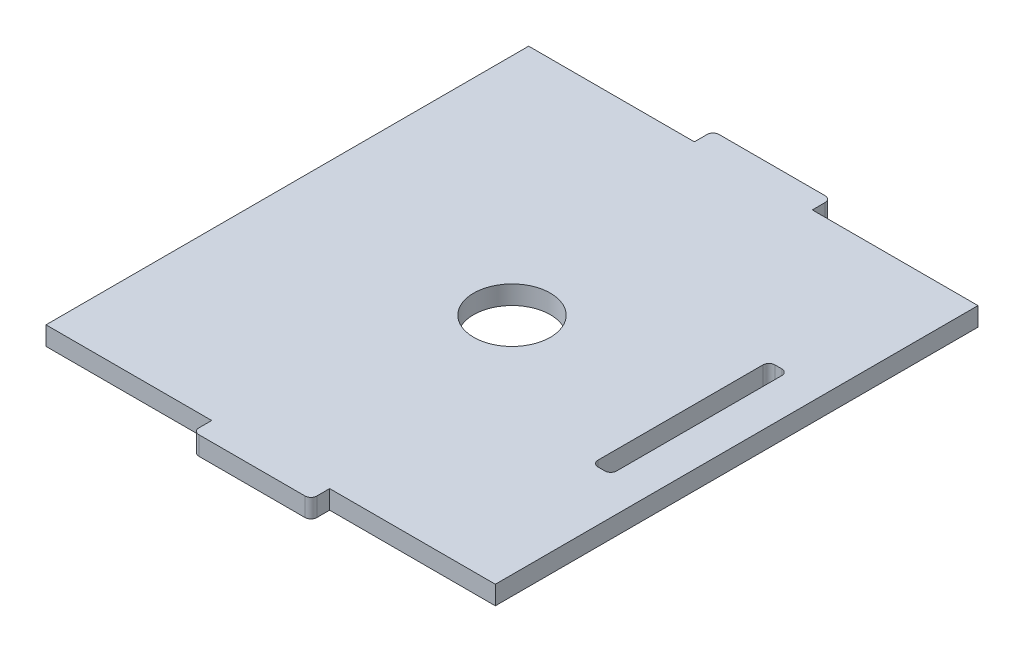
ISO-10303-21;
HEADER;
FILE_DESCRIPTION(('STEP AP214'),'2;1');
FILE_NAME('part.step','',(''),(''),'','','');
FILE_SCHEMA(('AUTOMOTIVE_DESIGN { 1 0 10303 214 1 1 1 1 }'));
ENDSEC;
DATA;
#1=APPLICATION_CONTEXT('core data for automotive mechanical design processes');
#2=APPLICATION_PROTOCOL_DEFINITION('international standard','automotive_design',2000,#1);
#3=PRODUCT_CONTEXT('',#1,'mechanical');
#4=PRODUCT('Part','Part','',(#3));
#5=PRODUCT_RELATED_PRODUCT_CATEGORY('part','',(#4));
#6=PRODUCT_DEFINITION_FORMATION('','',#4);
#7=PRODUCT_DEFINITION_CONTEXT('part definition',#1,'design');
#8=PRODUCT_DEFINITION('design','',#6,#7);
#9=PRODUCT_DEFINITION_SHAPE('','',#8);
#10=(LENGTH_UNIT() NAMED_UNIT(*) SI_UNIT(.MILLI.,.METRE.));
#11=(NAMED_UNIT(*) PLANE_ANGLE_UNIT() SI_UNIT($,.RADIAN.));
#12=(NAMED_UNIT(*) SI_UNIT($,.STERADIAN.) SOLID_ANGLE_UNIT());
#13=UNCERTAINTY_MEASURE_WITH_UNIT(LENGTH_MEASURE(1.E-05),#10,'distance_accuracy_value','');
#14=(GEOMETRIC_REPRESENTATION_CONTEXT(3) GLOBAL_UNCERTAINTY_ASSIGNED_CONTEXT((#13)) GLOBAL_UNIT_ASSIGNED_CONTEXT((#10,
#11,#12)) REPRESENTATION_CONTEXT('',''));
#15=CARTESIAN_POINT('',(0.,0.,0.));
#16=DIRECTION('',(0.,0.,1.));
#17=DIRECTION('',(1.,0.,0.));
#18=AXIS2_PLACEMENT_3D('',#15,#16,#17);
#19=CARTESIAN_POINT('',(10.,3.175,-40.925));
#20=DIRECTION('',(0.,0.,1.));
#21=DIRECTION('',(1.,0.,0.));
#22=AXIS2_PLACEMENT_3D('',#19,#20,#21);
#23=PLANE('',#22);
#24=DIRECTION('',(-1.,0.,0.));
#25=VECTOR('',#24,1.);
#26=CARTESIAN_POINT('',(10.,0.,-40.925));
#27=LINE('',#26,#25);
#28=CARTESIAN_POINT('',(38.1,0.,-40.925));
#29=VERTEX_POINT('',#28);
#30=CARTESIAN_POINT('',(10.,0.,-40.925));
#31=VERTEX_POINT('',#30);
#32=EDGE_CURVE('E235',#29,#31,#27,.T.);
#33=ORIENTED_EDGE('',*,*,#32,.T.);
#34=DIRECTION('',(0.,-1.,0.));
#35=VECTOR('',#34,1.);
#36=CARTESIAN_POINT('',(10.,3.175,-40.925));
#37=LINE('',#36,#35);
#38=CARTESIAN_POINT('',(10.,3.175,-40.925));
#39=VERTEX_POINT('',#38);
#40=EDGE_CURVE('E214',#39,#31,#37,.T.);
#41=ORIENTED_EDGE('',*,*,#40,.F.);
#42=DIRECTION('',(-1.,0.,0.));
#43=VECTOR('',#42,1.);
#44=CARTESIAN_POINT('',(10.,3.175,-40.925));
#45=LINE('',#44,#43);
#46=CARTESIAN_POINT('',(38.1,3.175,-40.925));
#47=VERTEX_POINT('',#46);
#48=EDGE_CURVE('E221',#47,#39,#45,.T.);
#49=ORIENTED_EDGE('',*,*,#48,.F.);
#50=DIRECTION('',(0.,-1.,0.));
#51=VECTOR('',#50,1.);
#52=CARTESIAN_POINT('',(38.1,3.175,-40.925));
#53=LINE('',#52,#51);
#54=EDGE_CURVE('E415',#47,#29,#53,.T.);
#55=ORIENTED_EDGE('',*,*,#54,.T.);
#56=EDGE_LOOP('',(#33,#41,#49,#55));
#57=FACE_BOUND('',#56,.T.);
#58=ADVANCED_FACE('F45',(#57),#23,.F.);
#59=CARTESIAN_POINT('',(10.,3.175,-40.925));
#60=DIRECTION('',(-1.,0.,0.));
#61=DIRECTION('',(0.,0.,1.));
#62=AXIS2_PLACEMENT_3D('',#59,#60,#61);
#63=PLANE('',#62);
#64=DIRECTION('',(0.,0.,-1.));
#65=VECTOR('',#64,1.);
#66=CARTESIAN_POINT('',(10.,0.,-40.925));
#67=LINE('',#66,#65);
#68=CARTESIAN_POINT('',(10.,0.,-43.1));
#69=VERTEX_POINT('',#68);
#70=EDGE_CURVE('E418',#31,#69,#67,.T.);
#71=ORIENTED_EDGE('',*,*,#70,.T.);
#72=DIRECTION('',(0.,-1.,0.));
#73=VECTOR('',#72,1.);
#74=CARTESIAN_POINT('',(10.,3.175,-43.1));
#75=LINE('',#74,#73);
#76=CARTESIAN_POINT('',(10.,3.175,-43.1));
#77=VERTEX_POINT('',#76);
#78=EDGE_CURVE('E217',#69,#77,#75,.F.);
#79=ORIENTED_EDGE('',*,*,#78,.T.);
#80=DIRECTION('',(0.,0.,-1.));
#81=VECTOR('',#80,1.);
#82=CARTESIAN_POINT('',(10.,3.175,-40.925));
#83=LINE('',#82,#81);
#84=EDGE_CURVE('E209',#39,#77,#83,.T.);
#85=ORIENTED_EDGE('',*,*,#84,.F.);
#86=ORIENTED_EDGE('',*,*,#40,.T.);
#87=EDGE_LOOP('',(#71,#79,#85,#86));
#88=FACE_BOUND('',#87,.T.);
#89=ADVANCED_FACE('F212',(#88),#63,.F.);
#90=CARTESIAN_POINT('',(-10.,3.175,-44.1));
#91=DIRECTION('',(0.,0.,1.));
#92=DIRECTION('',(1.,0.,0.));
#93=AXIS2_PLACEMENT_3D('',#90,#91,#92);
#94=PLANE('',#93);
#95=DIRECTION('',(-1.,0.,0.));
#96=VECTOR('',#95,1.);
#97=CARTESIAN_POINT('',(-10.,0.,-44.1));
#98=LINE('',#97,#96);
#99=CARTESIAN_POINT('',(9.,0.,-44.1));
#100=VERTEX_POINT('',#99);
#101=CARTESIAN_POINT('',(-9.,0.,-44.1));
#102=VERTEX_POINT('',#101);
#103=EDGE_CURVE('E422',#100,#102,#98,.T.);
#104=ORIENTED_EDGE('',*,*,#103,.T.);
#105=DIRECTION('',(0.,-1.,0.));
#106=VECTOR('',#105,1.);
#107=CARTESIAN_POINT('',(-9.,3.175,-44.1));
#108=LINE('',#107,#106);
#109=CARTESIAN_POINT('',(-9.,3.175,-44.1));
#110=VERTEX_POINT('',#109);
#111=EDGE_CURVE('E317',#102,#110,#108,.F.);
#112=ORIENTED_EDGE('',*,*,#111,.T.);
#113=DIRECTION('',(-1.,0.,0.));
#114=VECTOR('',#113,1.);
#115=CARTESIAN_POINT('',(-10.,3.175,-44.1));
#116=LINE('',#115,#114);
#117=CARTESIAN_POINT('',(9.,3.175,-44.1));
#118=VERTEX_POINT('',#117);
#119=EDGE_CURVE('E220',#118,#110,#116,.T.);
#120=ORIENTED_EDGE('',*,*,#119,.F.);
#121=DIRECTION('',(0.,-1.,0.));
#122=VECTOR('',#121,1.);
#123=CARTESIAN_POINT('',(9.,3.175,-44.1));
#124=LINE('',#123,#122);
#125=EDGE_CURVE('E313',#118,#100,#124,.T.);
#126=ORIENTED_EDGE('',*,*,#125,.T.);
#127=EDGE_LOOP('',(#104,#112,#120,#126));
#128=FACE_BOUND('',#127,.T.);
#129=ADVANCED_FACE('F520',(#128),#94,.F.);
#130=CARTESIAN_POINT('',(-10.,3.175,-40.925));
#131=DIRECTION('',(1.,0.,0.));
#132=DIRECTION('',(0.,0.,-1.));
#133=AXIS2_PLACEMENT_3D('',#130,#131,#132);
#134=PLANE('',#133);
#135=DIRECTION('',(0.,0.,1.));
#136=VECTOR('',#135,1.);
#137=CARTESIAN_POINT('',(-10.,3.175,-40.925));
#138=LINE('',#137,#136);
#139=CARTESIAN_POINT('',(-10.,3.175,-43.1));
#140=VERTEX_POINT('',#139);
#141=CARTESIAN_POINT('',(-10.,3.175,-40.925));
#142=VERTEX_POINT('',#141);
#143=EDGE_CURVE('E389',#140,#142,#138,.T.);
#144=ORIENTED_EDGE('',*,*,#143,.F.);
#145=DIRECTION('',(0.,-1.,0.));
#146=VECTOR('',#145,1.);
#147=CARTESIAN_POINT('',(-10.,3.175,-43.1));
#148=LINE('',#147,#146);
#149=CARTESIAN_POINT('',(-10.,0.,-43.1));
#150=VERTEX_POINT('',#149);
#151=EDGE_CURVE('E309',#140,#150,#148,.T.);
#152=ORIENTED_EDGE('',*,*,#151,.T.);
#153=DIRECTION('',(0.,0.,1.));
#154=VECTOR('',#153,1.);
#155=CARTESIAN_POINT('',(-10.,0.,-40.925));
#156=LINE('',#155,#154);
#157=CARTESIAN_POINT('',(-10.,0.,-40.925));
#158=VERTEX_POINT('',#157);
#159=EDGE_CURVE('E426',#150,#158,#156,.T.);
#160=ORIENTED_EDGE('',*,*,#159,.T.);
#161=DIRECTION('',(0.,-1.,0.));
#162=VECTOR('',#161,1.);
#163=CARTESIAN_POINT('',(-10.,3.175,-40.925));
#164=LINE('',#163,#162);
#165=EDGE_CURVE('E238',#142,#158,#164,.T.);
#166=ORIENTED_EDGE('',*,*,#165,.F.);
#167=EDGE_LOOP('',(#144,#152,#160,#166));
#168=FACE_BOUND('',#167,.T.);
#169=ADVANCED_FACE('F526',(#168),#134,.F.);
#170=CARTESIAN_POINT('',(-38.1,3.175,-40.925));
#171=DIRECTION('',(0.,0.,1.));
#172=DIRECTION('',(1.,0.,0.));
#173=AXIS2_PLACEMENT_3D('',#170,#171,#172);
#174=PLANE('',#173);
#175=DIRECTION('',(-1.,0.,0.));
#176=VECTOR('',#175,1.);
#177=CARTESIAN_POINT('',(-38.1,0.,-40.925));
#178=LINE('',#177,#176);
#179=CARTESIAN_POINT('',(-38.1,0.,-40.925));
#180=VERTEX_POINT('',#179);
#181=EDGE_CURVE('E429',#158,#180,#178,.T.);
#182=ORIENTED_EDGE('',*,*,#181,.T.);
#183=DIRECTION('',(0.,-1.,0.));
#184=VECTOR('',#183,1.);
#185=CARTESIAN_POINT('',(-38.1,3.175,-40.925));
#186=LINE('',#185,#184);
#187=CARTESIAN_POINT('',(-38.1,3.175,-40.925));
#188=VERTEX_POINT('',#187);
#189=EDGE_CURVE('E245',#188,#180,#186,.T.);
#190=ORIENTED_EDGE('',*,*,#189,.F.);
#191=DIRECTION('',(-1.,0.,0.));
#192=VECTOR('',#191,1.);
#193=CARTESIAN_POINT('',(-38.1,3.175,-40.925));
#194=LINE('',#193,#192);
#195=EDGE_CURVE('E392',#142,#188,#194,.T.);
#196=ORIENTED_EDGE('',*,*,#195,.F.);
#197=ORIENTED_EDGE('',*,*,#165,.T.);
#198=EDGE_LOOP('',(#182,#190,#196,#197));
#199=FACE_BOUND('',#198,.T.);
#200=ADVANCED_FACE('F528',(#199),#174,.F.);
#201=CARTESIAN_POINT('',(-38.1,3.175,40.925));
#202=DIRECTION('',(1.,0.,0.));
#203=DIRECTION('',(0.,0.,-1.));
#204=AXIS2_PLACEMENT_3D('',#201,#202,#203);
#205=PLANE('',#204);
#206=DIRECTION('',(0.,0.,1.));
#207=VECTOR('',#206,1.);
#208=CARTESIAN_POINT('',(-38.1,0.,40.925));
#209=LINE('',#208,#207);
#210=CARTESIAN_POINT('',(-38.1,0.,40.925));
#211=VERTEX_POINT('',#210);
#212=EDGE_CURVE('E432',#180,#211,#209,.T.);
#213=ORIENTED_EDGE('',*,*,#212,.T.);
#214=DIRECTION('',(0.,-1.,0.));
#215=VECTOR('',#214,1.);
#216=CARTESIAN_POINT('',(-38.1,3.175,40.925));
#217=LINE('',#216,#215);
#218=CARTESIAN_POINT('',(-38.1,3.175,40.925));
#219=VERTEX_POINT('',#218);
#220=EDGE_CURVE('E467',#219,#211,#217,.T.);
#221=ORIENTED_EDGE('',*,*,#220,.F.);
#222=DIRECTION('',(0.,0.,1.));
#223=VECTOR('',#222,1.);
#224=CARTESIAN_POINT('',(-38.1,3.175,40.925));
#225=LINE('',#224,#223);
#226=EDGE_CURVE('E395',#188,#219,#225,.T.);
#227=ORIENTED_EDGE('',*,*,#226,.F.);
#228=ORIENTED_EDGE('',*,*,#189,.T.);
#229=EDGE_LOOP('',(#213,#221,#227,#228));
#230=FACE_BOUND('',#229,.T.);
#231=ADVANCED_FACE('F476',(#230),#205,.F.);
#232=CARTESIAN_POINT('',(-38.1,3.175,40.925));
#233=DIRECTION('',(0.,0.,-1.));
#234=DIRECTION('',(-1.,0.,0.));
#235=AXIS2_PLACEMENT_3D('',#232,#233,#234);
#236=PLANE('',#235);
#237=DIRECTION('',(1.,0.,0.));
#238=VECTOR('',#237,1.);
#239=CARTESIAN_POINT('',(-38.1,0.,40.925));
#240=LINE('',#239,#238);
#241=CARTESIAN_POINT('',(-10.,0.,40.925));
#242=VERTEX_POINT('',#241);
#243=EDGE_CURVE('E435',#211,#242,#240,.T.);
#244=ORIENTED_EDGE('',*,*,#243,.T.);
#245=DIRECTION('',(0.,-1.,0.));
#246=VECTOR('',#245,1.);
#247=CARTESIAN_POINT('',(-10.,3.175,40.925));
#248=LINE('',#247,#246);
#249=CARTESIAN_POINT('',(-10.,3.175,40.925));
#250=VERTEX_POINT('',#249);
#251=EDGE_CURVE('E463',#250,#242,#248,.T.);
#252=ORIENTED_EDGE('',*,*,#251,.F.);
#253=DIRECTION('',(1.,0.,0.));
#254=VECTOR('',#253,1.);
#255=CARTESIAN_POINT('',(-38.1,3.175,40.925));
#256=LINE('',#255,#254);
#257=EDGE_CURVE('E398',#219,#250,#256,.T.);
#258=ORIENTED_EDGE('',*,*,#257,.F.);
#259=ORIENTED_EDGE('',*,*,#220,.T.);
#260=EDGE_LOOP('',(#244,#252,#258,#259));
#261=FACE_BOUND('',#260,.T.);
#262=ADVANCED_FACE('F487',(#261),#236,.F.);
#263=CARTESIAN_POINT('',(-10.,3.175,40.925));
#264=DIRECTION('',(1.,0.,0.));
#265=DIRECTION('',(0.,0.,-1.));
#266=AXIS2_PLACEMENT_3D('',#263,#264,#265);
#267=PLANE('',#266);
#268=DIRECTION('',(0.,0.,1.));
#269=VECTOR('',#268,1.);
#270=CARTESIAN_POINT('',(-10.,0.,40.925));
#271=LINE('',#270,#269);
#272=CARTESIAN_POINT('',(-10.,0.,43.1));
#273=VERTEX_POINT('',#272);
#274=EDGE_CURVE('E438',#242,#273,#271,.T.);
#275=ORIENTED_EDGE('',*,*,#274,.T.);
#276=DIRECTION('',(0.,-1.,0.));
#277=VECTOR('',#276,1.);
#278=CARTESIAN_POINT('',(-10.,3.175,43.1));
#279=LINE('',#278,#277);
#280=CARTESIAN_POINT('',(-10.,3.175,43.1));
#281=VERTEX_POINT('',#280);
#282=EDGE_CURVE('E61',#273,#281,#279,.F.);
#283=ORIENTED_EDGE('',*,*,#282,.T.);
#284=DIRECTION('',(0.,0.,1.));
#285=VECTOR('',#284,1.);
#286=CARTESIAN_POINT('',(-10.,3.175,40.925));
#287=LINE('',#286,#285);
#288=EDGE_CURVE('E401',#250,#281,#287,.T.);
#289=ORIENTED_EDGE('',*,*,#288,.F.);
#290=ORIENTED_EDGE('',*,*,#251,.T.);
#291=EDGE_LOOP('',(#275,#283,#289,#290));
#292=FACE_BOUND('',#291,.T.);
#293=ADVANCED_FACE('F489',(#292),#267,.F.);
#294=CARTESIAN_POINT('',(-10.,3.175,44.1));
#295=DIRECTION('',(0.,0.,-1.));
#296=DIRECTION('',(-1.,0.,0.));
#297=AXIS2_PLACEMENT_3D('',#294,#295,#296);
#298=PLANE('',#297);
#299=DIRECTION('',(1.,0.,0.));
#300=VECTOR('',#299,1.);
#301=CARTESIAN_POINT('',(-10.,0.,44.1));
#302=LINE('',#301,#300);
#303=CARTESIAN_POINT('',(-9.,0.,44.1));
#304=VERTEX_POINT('',#303);
#305=CARTESIAN_POINT('',(9.,0.,44.1));
#306=VERTEX_POINT('',#305);
#307=EDGE_CURVE('E441',#304,#306,#302,.T.);
#308=ORIENTED_EDGE('',*,*,#307,.T.);
#309=DIRECTION('',(0.,-1.,0.));
#310=VECTOR('',#309,1.);
#311=CARTESIAN_POINT('',(9.,3.175,44.1));
#312=LINE('',#311,#310);
#313=CARTESIAN_POINT('',(9.,3.175,44.1));
#314=VERTEX_POINT('',#313);
#315=EDGE_CURVE('E293',#306,#314,#312,.F.);
#316=ORIENTED_EDGE('',*,*,#315,.T.);
#317=DIRECTION('',(1.,0.,0.));
#318=VECTOR('',#317,1.);
#319=CARTESIAN_POINT('',(-10.,3.175,44.1));
#320=LINE('',#319,#318);
#321=CARTESIAN_POINT('',(-9.,3.175,44.1));
#322=VERTEX_POINT('',#321);
#323=EDGE_CURVE('E404',#322,#314,#320,.T.);
#324=ORIENTED_EDGE('',*,*,#323,.F.);
#325=DIRECTION('',(0.,-1.,0.));
#326=VECTOR('',#325,1.);
#327=CARTESIAN_POINT('',(-9.,3.175,44.1));
#328=LINE('',#327,#326);
#329=EDGE_CURVE('E289',#322,#304,#328,.T.);
#330=ORIENTED_EDGE('',*,*,#329,.T.);
#331=EDGE_LOOP('',(#308,#316,#324,#330));
#332=FACE_BOUND('',#331,.T.);
#333=ADVANCED_FACE('F497',(#332),#298,.F.);
#334=CARTESIAN_POINT('',(10.,3.175,40.925));
#335=DIRECTION('',(-1.,0.,0.));
#336=DIRECTION('',(0.,0.,1.));
#337=AXIS2_PLACEMENT_3D('',#334,#335,#336);
#338=PLANE('',#337);
#339=DIRECTION('',(0.,0.,-1.));
#340=VECTOR('',#339,1.);
#341=CARTESIAN_POINT('',(10.,3.175,40.925));
#342=LINE('',#341,#340);
#343=CARTESIAN_POINT('',(10.,3.175,43.1));
#344=VERTEX_POINT('',#343);
#345=CARTESIAN_POINT('',(10.,3.175,40.925));
#346=VERTEX_POINT('',#345);
#347=EDGE_CURVE('E407',#344,#346,#342,.T.);
#348=ORIENTED_EDGE('',*,*,#347,.F.);
#349=DIRECTION('',(0.,-1.,0.));
#350=VECTOR('',#349,1.);
#351=CARTESIAN_POINT('',(10.,3.175,43.1));
#352=LINE('',#351,#350);
#353=CARTESIAN_POINT('',(10.,0.,43.1));
#354=VERTEX_POINT('',#353);
#355=EDGE_CURVE('E273',#344,#354,#352,.T.);
#356=ORIENTED_EDGE('',*,*,#355,.T.);
#357=DIRECTION('',(0.,0.,-1.));
#358=VECTOR('',#357,1.);
#359=CARTESIAN_POINT('',(10.,0.,40.925));
#360=LINE('',#359,#358);
#361=CARTESIAN_POINT('',(10.,0.,40.925));
#362=VERTEX_POINT('',#361);
#363=EDGE_CURVE('E445',#354,#362,#360,.T.);
#364=ORIENTED_EDGE('',*,*,#363,.T.);
#365=DIRECTION('',(0.,-1.,0.));
#366=VECTOR('',#365,1.);
#367=CARTESIAN_POINT('',(10.,3.175,40.925));
#368=LINE('',#367,#366);
#369=EDGE_CURVE('E459',#346,#362,#368,.T.);
#370=ORIENTED_EDGE('',*,*,#369,.F.);
#371=EDGE_LOOP('',(#348,#356,#364,#370));
#372=FACE_BOUND('',#371,.T.);
#373=ADVANCED_FACE('F506',(#372),#338,.F.);
#374=CARTESIAN_POINT('',(10.,3.175,40.925));
#375=DIRECTION('',(0.,0.,-1.));
#376=DIRECTION('',(-1.,0.,0.));
#377=AXIS2_PLACEMENT_3D('',#374,#375,#376);
#378=PLANE('',#377);
#379=DIRECTION('',(1.,0.,0.));
#380=VECTOR('',#379,1.);
#381=CARTESIAN_POINT('',(10.,0.,40.925));
#382=LINE('',#381,#380);
#383=CARTESIAN_POINT('',(38.1,0.,40.925));
#384=VERTEX_POINT('',#383);
#385=EDGE_CURVE('E448',#362,#384,#382,.T.);
#386=ORIENTED_EDGE('',*,*,#385,.T.);
#387=DIRECTION('',(0.,-1.,0.));
#388=VECTOR('',#387,1.);
#389=CARTESIAN_POINT('',(38.1,3.175,40.925));
#390=LINE('',#389,#388);
#391=CARTESIAN_POINT('',(38.1,3.175,40.925));
#392=VERTEX_POINT('',#391);
#393=EDGE_CURVE('E455',#392,#384,#390,.T.);
#394=ORIENTED_EDGE('',*,*,#393,.F.);
#395=DIRECTION('',(1.,0.,0.));
#396=VECTOR('',#395,1.);
#397=CARTESIAN_POINT('',(10.,3.175,40.925));
#398=LINE('',#397,#396);
#399=EDGE_CURVE('E410',#346,#392,#398,.T.);
#400=ORIENTED_EDGE('',*,*,#399,.F.);
#401=ORIENTED_EDGE('',*,*,#369,.T.);
#402=EDGE_LOOP('',(#386,#394,#400,#401));
#403=FACE_BOUND('',#402,.T.);
#404=ADVANCED_FACE('F511',(#403),#378,.F.);
#405=CARTESIAN_POINT('',(38.1,3.175,40.925));
#406=DIRECTION('',(-1.,0.,0.));
#407=DIRECTION('',(0.,0.,1.));
#408=AXIS2_PLACEMENT_3D('',#405,#406,#407);
#409=PLANE('',#408);
#410=DIRECTION('',(0.,0.,-1.));
#411=VECTOR('',#410,1.);
#412=CARTESIAN_POINT('',(38.1,0.,40.925));
#413=LINE('',#412,#411);
#414=EDGE_CURVE('E232',#384,#29,#413,.T.);
#415=ORIENTED_EDGE('',*,*,#414,.T.);
#416=ORIENTED_EDGE('',*,*,#54,.F.);
#417=DIRECTION('',(0.,0.,-1.));
#418=VECTOR('',#417,1.);
#419=CARTESIAN_POINT('',(38.1,3.175,40.925));
#420=LINE('',#419,#418);
#421=EDGE_CURVE('E227',#392,#47,#420,.T.);
#422=ORIENTED_EDGE('',*,*,#421,.F.);
#423=ORIENTED_EDGE('',*,*,#393,.T.);
#424=EDGE_LOOP('',(#415,#416,#422,#423));
#425=FACE_BOUND('',#424,.T.);
#426=ADVANCED_FACE('F514',(#425),#409,.F.);
#427=CARTESIAN_POINT('',(0.,3.175,0.));
#428=DIRECTION('',(0.,1.,0.));
#429=DIRECTION('',(0.,0.,1.));
#430=AXIS2_PLACEMENT_3D('',#427,#428,#429);
#431=PLANE('',#430);
#432=CARTESIAN_POINT('',(0.,3.175,0.));
#433=DIRECTION('',(0.,1.,0.));
#434=DIRECTION('',(0.,0.,1.));
#435=AXIS2_PLACEMENT_3D('',#432,#433,#434);
#436=CIRCLE('',#435,6.5);
#437=CARTESIAN_POINT('',(0.,3.175,6.5));
#438=VERTEX_POINT('',#437);
#439=EDGE_CURVE('E759',#438,#438,#436,.T.);
#440=ORIENTED_EDGE('',*,*,#439,.F.);
#441=EDGE_LOOP('',(#440));
#442=FACE_BOUND('',#441,.T.);
#443=DIRECTION('',(0.,0.,1.));
#444=VECTOR('',#443,1.);
#445=CARTESIAN_POINT('',(28.575,3.175,-15.));
#446=LINE('',#445,#444);
#447=CARTESIAN_POINT('',(28.575,3.175,-14.));
#448=VERTEX_POINT('',#447);
#449=CARTESIAN_POINT('',(28.575,3.175,14.));
#450=VERTEX_POINT('',#449);
#451=EDGE_CURVE('E357',#448,#450,#446,.T.);
#452=ORIENTED_EDGE('',*,*,#451,.F.);
#453=CARTESIAN_POINT('',(29.575,3.175,-14.));
#454=DIRECTION('',(0.,1.,0.));
#455=DIRECTION('',(0.,0.,1.));
#456=AXIS2_PLACEMENT_3D('',#453,#454,#455);
#457=CIRCLE('',#456,1.);
#458=CARTESIAN_POINT('',(29.575,3.175,-15.));
#459=VERTEX_POINT('',#458);
#460=EDGE_CURVE('E322',#448,#459,#457,.F.);
#461=ORIENTED_EDGE('',*,*,#460,.T.);
#462=DIRECTION('',(-1.,0.,0.));
#463=VECTOR('',#462,1.);
#464=CARTESIAN_POINT('',(31.75,3.175,-15.));
#465=LINE('',#464,#463);
#466=CARTESIAN_POINT('',(30.75,3.175,-15.));
#467=VERTEX_POINT('',#466);
#468=EDGE_CURVE('E385',#467,#459,#465,.T.);
#469=ORIENTED_EDGE('',*,*,#468,.F.);
#470=CARTESIAN_POINT('',(30.75,3.175,-14.));
#471=DIRECTION('',(0.,1.,0.));
#472=DIRECTION('',(0.,0.,1.));
#473=AXIS2_PLACEMENT_3D('',#470,#471,#472);
#474=CIRCLE('',#473,1.);
#475=CARTESIAN_POINT('',(31.75,3.175,-14.));
#476=VERTEX_POINT('',#475);
#477=EDGE_CURVE('E328',#467,#476,#474,.F.);
#478=ORIENTED_EDGE('',*,*,#477,.T.);
#479=DIRECTION('',(0.,0.,-1.));
#480=VECTOR('',#479,1.);
#481=CARTESIAN_POINT('',(31.75,3.175,-15.));
#482=LINE('',#481,#480);
#483=CARTESIAN_POINT('',(31.75,3.175,14.));
#484=VERTEX_POINT('',#483);
#485=EDGE_CURVE('E347',#484,#476,#482,.T.);
#486=ORIENTED_EDGE('',*,*,#485,.F.);
#487=CARTESIAN_POINT('',(30.75,3.175,14.));
#488=DIRECTION('',(0.,1.,0.));
#489=DIRECTION('',(0.,0.,1.));
#490=AXIS2_PLACEMENT_3D('',#487,#488,#489);
#491=CIRCLE('',#490,1.);
#492=CARTESIAN_POINT('',(30.75,3.175,15.));
#493=VERTEX_POINT('',#492);
#494=EDGE_CURVE('E54',#484,#493,#491,.F.);
#495=ORIENTED_EDGE('',*,*,#494,.T.);
#496=DIRECTION('',(1.,0.,0.));
#497=VECTOR('',#496,1.);
#498=CARTESIAN_POINT('',(31.75,3.175,15.));
#499=LINE('',#498,#497);
#500=CARTESIAN_POINT('',(29.575,3.175,15.));
#501=VERTEX_POINT('',#500);
#502=EDGE_CURVE('E345',#501,#493,#499,.T.);
#503=ORIENTED_EDGE('',*,*,#502,.F.);
#504=CARTESIAN_POINT('',(29.575,3.175,14.));
#505=DIRECTION('',(0.,1.,0.));
#506=DIRECTION('',(0.,0.,1.));
#507=AXIS2_PLACEMENT_3D('',#504,#505,#506);
#508=CIRCLE('',#507,1.);
#509=EDGE_CURVE('E334',#501,#450,#508,.F.);
#510=ORIENTED_EDGE('',*,*,#509,.T.);
#511=EDGE_LOOP('',(#452,#461,#469,#478,#486,#495,#503,#510));
#512=FACE_BOUND('',#511,.T.);
#513=ORIENTED_EDGE('',*,*,#323,.T.);
#514=CARTESIAN_POINT('',(9.,3.175,43.1));
#515=DIRECTION('',(0.,1.,0.));
#516=DIRECTION('',(0.,0.,1.));
#517=AXIS2_PLACEMENT_3D('',#514,#515,#516);
#518=CIRCLE('',#517,1.);
#519=EDGE_CURVE('E304',#314,#344,#518,.T.);
#520=ORIENTED_EDGE('',*,*,#519,.T.);
#521=ORIENTED_EDGE('',*,*,#347,.T.);
#522=ORIENTED_EDGE('',*,*,#399,.T.);
#523=ORIENTED_EDGE('',*,*,#421,.T.);
#524=ORIENTED_EDGE('',*,*,#48,.T.);
#525=ORIENTED_EDGE('',*,*,#84,.T.);
#526=CARTESIAN_POINT('',(9.,3.175,-43.1));
#527=DIRECTION('',(0.,1.,0.));
#528=DIRECTION('',(0.,0.,1.));
#529=AXIS2_PLACEMENT_3D('',#526,#527,#528);
#530=CIRCLE('',#529,1.);
#531=EDGE_CURVE('E296',#77,#118,#530,.T.);
#532=ORIENTED_EDGE('',*,*,#531,.T.);
#533=ORIENTED_EDGE('',*,*,#119,.T.);
#534=CARTESIAN_POINT('',(-9.,3.175,-43.1));
#535=DIRECTION('',(0.,1.,0.));
#536=DIRECTION('',(0.,0.,1.));
#537=AXIS2_PLACEMENT_3D('',#534,#535,#536);
#538=CIRCLE('',#537,1.);
#539=EDGE_CURVE('E69',#110,#140,#538,.T.);
#540=ORIENTED_EDGE('',*,*,#539,.T.);
#541=ORIENTED_EDGE('',*,*,#143,.T.);
#542=ORIENTED_EDGE('',*,*,#195,.T.);
#543=ORIENTED_EDGE('',*,*,#226,.T.);
#544=ORIENTED_EDGE('',*,*,#257,.T.);
#545=ORIENTED_EDGE('',*,*,#288,.T.);
#546=CARTESIAN_POINT('',(-9.,3.175,43.1));
#547=DIRECTION('',(0.,1.,0.));
#548=DIRECTION('',(0.,0.,1.));
#549=AXIS2_PLACEMENT_3D('',#546,#547,#548);
#550=CIRCLE('',#549,1.);
#551=EDGE_CURVE('E301',#281,#322,#550,.T.);
#552=ORIENTED_EDGE('',*,*,#551,.T.);
#553=EDGE_LOOP('',(#513,#520,#521,#522,#523,#524,#525,#532,#533,#540,#541,#542,#543,#544,#545,#552));
#554=FACE_BOUND('',#553,.T.);
#555=ADVANCED_FACE('F225',(#442,#512,#554),#431,.T.);
#556=CARTESIAN_POINT('',(0.,0.,0.));
#557=DIRECTION('',(0.,1.,0.));
#558=DIRECTION('',(0.,0.,1.));
#559=AXIS2_PLACEMENT_3D('',#556,#557,#558);
#560=PLANE('',#559);
#561=CARTESIAN_POINT('',(0.,0.,0.));
#562=DIRECTION('',(0.,1.,0.));
#563=DIRECTION('',(0.,0.,1.));
#564=AXIS2_PLACEMENT_3D('',#561,#562,#563);
#565=CIRCLE('',#564,6.5);
#566=CARTESIAN_POINT('',(0.,0.,6.5));
#567=VERTEX_POINT('',#566);
#568=EDGE_CURVE('E419',#567,#567,#565,.T.);
#569=ORIENTED_EDGE('',*,*,#568,.T.);
#570=EDGE_LOOP('',(#569));
#571=FACE_BOUND('',#570,.T.);
#572=DIRECTION('',(0.,0.,-1.));
#573=VECTOR('',#572,1.);
#574=CARTESIAN_POINT('',(31.75,0.,-15.));
#575=LINE('',#574,#573);
#576=CARTESIAN_POINT('',(31.75,0.,14.));
#577=VERTEX_POINT('',#576);
#578=CARTESIAN_POINT('',(31.75,0.,-14.));
#579=VERTEX_POINT('',#578);
#580=EDGE_CURVE('E366',#577,#579,#575,.T.);
#581=ORIENTED_EDGE('',*,*,#580,.T.);
#582=CARTESIAN_POINT('',(30.75,0.,-14.));
#583=DIRECTION('',(0.,1.,0.));
#584=DIRECTION('',(0.,0.,1.));
#585=AXIS2_PLACEMENT_3D('',#582,#583,#584);
#586=CIRCLE('',#585,1.);
#587=CARTESIAN_POINT('',(30.75,0.,-15.));
#588=VERTEX_POINT('',#587);
#589=EDGE_CURVE('E331',#579,#588,#586,.T.);
#590=ORIENTED_EDGE('',*,*,#589,.T.);
#591=DIRECTION('',(-1.,0.,0.));
#592=VECTOR('',#591,1.);
#593=CARTESIAN_POINT('',(31.75,0.,-15.));
#594=LINE('',#593,#592);
#595=CARTESIAN_POINT('',(29.575,0.,-15.));
#596=VERTEX_POINT('',#595);
#597=EDGE_CURVE('E373',#588,#596,#594,.T.);
#598=ORIENTED_EDGE('',*,*,#597,.T.);
#599=CARTESIAN_POINT('',(29.575,0.,-14.));
#600=DIRECTION('',(0.,1.,0.));
#601=DIRECTION('',(0.,0.,1.));
#602=AXIS2_PLACEMENT_3D('',#599,#600,#601);
#603=CIRCLE('',#602,1.);
#604=CARTESIAN_POINT('',(28.575,0.,-14.));
#605=VERTEX_POINT('',#604);
#606=EDGE_CURVE('E325',#596,#605,#603,.T.);
#607=ORIENTED_EDGE('',*,*,#606,.T.);
#608=DIRECTION('',(0.,0.,1.));
#609=VECTOR('',#608,1.);
#610=CARTESIAN_POINT('',(28.575,0.,-15.));
#611=LINE('',#610,#609);
#612=CARTESIAN_POINT('',(28.575,0.,14.));
#613=VERTEX_POINT('',#612);
#614=EDGE_CURVE('E377',#605,#613,#611,.T.);
#615=ORIENTED_EDGE('',*,*,#614,.T.);
#616=CARTESIAN_POINT('',(29.575,0.,14.));
#617=DIRECTION('',(0.,1.,0.));
#618=DIRECTION('',(0.,0.,1.));
#619=AXIS2_PLACEMENT_3D('',#616,#617,#618);
#620=CIRCLE('',#619,1.);
#621=CARTESIAN_POINT('',(29.575,0.,15.));
#622=VERTEX_POINT('',#621);
#623=EDGE_CURVE('E337',#613,#622,#620,.T.);
#624=ORIENTED_EDGE('',*,*,#623,.T.);
#625=DIRECTION('',(1.,0.,0.));
#626=VECTOR('',#625,1.);
#627=CARTESIAN_POINT('',(31.75,0.,15.));
#628=LINE('',#627,#626);
#629=CARTESIAN_POINT('',(30.75,0.,15.));
#630=VERTEX_POINT('',#629);
#631=EDGE_CURVE('E368',#622,#630,#628,.T.);
#632=ORIENTED_EDGE('',*,*,#631,.T.);
#633=CARTESIAN_POINT('',(30.75,0.,14.));
#634=DIRECTION('',(0.,1.,0.));
#635=DIRECTION('',(0.,0.,1.));
#636=AXIS2_PLACEMENT_3D('',#633,#634,#635);
#637=CIRCLE('',#636,1.);
#638=EDGE_CURVE('E11',#630,#577,#637,.T.);
#639=ORIENTED_EDGE('',*,*,#638,.T.);
#640=EDGE_LOOP('',(#581,#590,#598,#607,#615,#624,#632,#639));
#641=FACE_BOUND('',#640,.T.);
#642=ORIENTED_EDGE('',*,*,#363,.F.);
#643=CARTESIAN_POINT('',(9.,0.,43.1));
#644=DIRECTION('',(0.,1.,0.));
#645=DIRECTION('',(0.,0.,1.));
#646=AXIS2_PLACEMENT_3D('',#643,#644,#645);
#647=CIRCLE('',#646,1.);
#648=EDGE_CURVE('E286',#354,#306,#647,.F.);
#649=ORIENTED_EDGE('',*,*,#648,.T.);
#650=ORIENTED_EDGE('',*,*,#307,.F.);
#651=CARTESIAN_POINT('',(-9.,0.,43.1));
#652=DIRECTION('',(0.,1.,0.));
#653=DIRECTION('',(0.,0.,1.));
#654=AXIS2_PLACEMENT_3D('',#651,#652,#653);
#655=CIRCLE('',#654,1.);
#656=EDGE_CURVE('E283',#304,#273,#655,.F.);
#657=ORIENTED_EDGE('',*,*,#656,.T.);
#658=ORIENTED_EDGE('',*,*,#274,.F.);
#659=ORIENTED_EDGE('',*,*,#243,.F.);
#660=ORIENTED_EDGE('',*,*,#212,.F.);
#661=ORIENTED_EDGE('',*,*,#181,.F.);
#662=ORIENTED_EDGE('',*,*,#159,.F.);
#663=CARTESIAN_POINT('',(-9.,0.,-43.1));
#664=DIRECTION('',(0.,1.,0.));
#665=DIRECTION('',(0.,0.,1.));
#666=AXIS2_PLACEMENT_3D('',#663,#664,#665);
#667=CIRCLE('',#666,1.);
#668=EDGE_CURVE('E280',#150,#102,#667,.F.);
#669=ORIENTED_EDGE('',*,*,#668,.T.);
#670=ORIENTED_EDGE('',*,*,#103,.F.);
#671=CARTESIAN_POINT('',(9.,0.,-43.1));
#672=DIRECTION('',(0.,1.,0.));
#673=DIRECTION('',(0.,0.,1.));
#674=AXIS2_PLACEMENT_3D('',#671,#672,#673);
#675=CIRCLE('',#674,1.);
#676=EDGE_CURVE('E277',#100,#69,#675,.F.);
#677=ORIENTED_EDGE('',*,*,#676,.T.);
#678=ORIENTED_EDGE('',*,*,#70,.F.);
#679=ORIENTED_EDGE('',*,*,#32,.F.);
#680=ORIENTED_EDGE('',*,*,#414,.F.);
#681=ORIENTED_EDGE('',*,*,#385,.F.);
#682=EDGE_LOOP('',(#642,#649,#650,#657,#658,#659,#660,#661,#662,#669,#670,#677,#678,#679,#680,#681));
#683=FACE_BOUND('',#682,.T.);
#684=ADVANCED_FACE('F364',(#571,#641,#683),#560,.F.);
#685=CARTESIAN_POINT('',(28.575,0.,-15.));
#686=DIRECTION('',(-1.,0.,0.));
#687=DIRECTION('',(0.,0.,1.));
#688=AXIS2_PLACEMENT_3D('',#685,#686,#687);
#689=PLANE('',#688);
#690=ORIENTED_EDGE('',*,*,#614,.F.);
#691=DIRECTION('',(0.,1.,0.));
#692=VECTOR('',#691,1.);
#693=CARTESIAN_POINT('',(28.575,3.175,-14.));
#694=LINE('',#693,#692);
#695=EDGE_CURVE('E242',#605,#448,#694,.T.);
#696=ORIENTED_EDGE('',*,*,#695,.T.);
#697=ORIENTED_EDGE('',*,*,#451,.T.);
#698=DIRECTION('',(0.,1.,0.));
#699=VECTOR('',#698,1.);
#700=CARTESIAN_POINT('',(28.575,0.,14.));
#701=LINE('',#700,#699);
#702=EDGE_CURVE('E237',#450,#613,#701,.F.);
#703=ORIENTED_EDGE('',*,*,#702,.T.);
#704=EDGE_LOOP('',(#690,#696,#697,#703));
#705=FACE_BOUND('',#704,.T.);
#706=ADVANCED_FACE('F646',(#705),#689,.F.);
#707=CARTESIAN_POINT('',(31.75,0.,-15.));
#708=DIRECTION('',(0.,0.,-1.));
#709=DIRECTION('',(-1.,0.,0.));
#710=AXIS2_PLACEMENT_3D('',#707,#708,#709);
#711=PLANE('',#710);
#712=ORIENTED_EDGE('',*,*,#468,.T.);
#713=DIRECTION('',(0.,1.,0.));
#714=VECTOR('',#713,1.);
#715=CARTESIAN_POINT('',(29.575,0.,-15.));
#716=LINE('',#715,#714);
#717=EDGE_CURVE('E256',#459,#596,#716,.F.);
#718=ORIENTED_EDGE('',*,*,#717,.T.);
#719=ORIENTED_EDGE('',*,*,#597,.F.);
#720=DIRECTION('',(0.,1.,0.));
#721=VECTOR('',#720,1.);
#722=CARTESIAN_POINT('',(30.75,3.175,-15.));
#723=LINE('',#722,#721);
#724=EDGE_CURVE('E252',#588,#467,#723,.T.);
#725=ORIENTED_EDGE('',*,*,#724,.T.);
#726=EDGE_LOOP('',(#712,#718,#719,#725));
#727=FACE_BOUND('',#726,.T.);
#728=ADVANCED_FACE('F637',(#727),#711,.F.);
#729=CARTESIAN_POINT('',(31.75,0.,-15.));
#730=DIRECTION('',(1.,0.,0.));
#731=DIRECTION('',(0.,0.,-1.));
#732=AXIS2_PLACEMENT_3D('',#729,#730,#731);
#733=PLANE('',#732);
#734=ORIENTED_EDGE('',*,*,#485,.T.);
#735=DIRECTION('',(0.,1.,0.));
#736=VECTOR('',#735,1.);
#737=CARTESIAN_POINT('',(31.75,0.,-14.));
#738=LINE('',#737,#736);
#739=EDGE_CURVE('E263',#476,#579,#738,.F.);
#740=ORIENTED_EDGE('',*,*,#739,.T.);
#741=ORIENTED_EDGE('',*,*,#580,.F.);
#742=DIRECTION('',(0.,1.,0.));
#743=VECTOR('',#742,1.);
#744=CARTESIAN_POINT('',(31.75,3.175,14.));
#745=LINE('',#744,#743);
#746=EDGE_CURVE('E259',#577,#484,#745,.T.);
#747=ORIENTED_EDGE('',*,*,#746,.T.);
#748=EDGE_LOOP('',(#734,#740,#741,#747));
#749=FACE_BOUND('',#748,.T.);
#750=ADVANCED_FACE('F370',(#749),#733,.F.);
#751=CARTESIAN_POINT('',(31.75,0.,15.));
#752=DIRECTION('',(0.,0.,1.));
#753=DIRECTION('',(1.,0.,0.));
#754=AXIS2_PLACEMENT_3D('',#751,#752,#753);
#755=PLANE('',#754);
#756=ORIENTED_EDGE('',*,*,#631,.F.);
#757=DIRECTION('',(0.,1.,0.));
#758=VECTOR('',#757,1.);
#759=CARTESIAN_POINT('',(29.575,3.175,15.));
#760=LINE('',#759,#758);
#761=EDGE_CURVE('E269',#622,#501,#760,.T.);
#762=ORIENTED_EDGE('',*,*,#761,.T.);
#763=ORIENTED_EDGE('',*,*,#502,.T.);
#764=DIRECTION('',(0.,1.,0.));
#765=VECTOR('',#764,1.);
#766=CARTESIAN_POINT('',(30.75,0.,15.));
#767=LINE('',#766,#765);
#768=EDGE_CURVE('E266',#493,#630,#767,.F.);
#769=ORIENTED_EDGE('',*,*,#768,.T.);
#770=EDGE_LOOP('',(#756,#762,#763,#769));
#771=FACE_BOUND('',#770,.T.);
#772=ADVANCED_FACE('F353',(#771),#755,.F.);
#773=CARTESIAN_POINT('',(0.,0.,0.));
#774=DIRECTION('',(0.,1.,0.));
#775=DIRECTION('',(0.,0.,1.));
#776=AXIS2_PLACEMENT_3D('',#773,#774,#775);
#777=CYLINDRICAL_SURFACE('',#776,6.5);
#778=ORIENTED_EDGE('',*,*,#568,.F.);
#779=EDGE_LOOP('',(#778));
#780=FACE_BOUND('',#779,.T.);
#781=ORIENTED_EDGE('',*,*,#439,.T.);
#782=EDGE_LOOP('',(#781));
#783=FACE_BOUND('',#782,.T.);
#784=ADVANCED_FACE('F549',(#780,#783),#777,.F.);
#785=CARTESIAN_POINT('',(29.575,0.,-14.));
#786=DIRECTION('',(0.,-1.,0.));
#787=DIRECTION('',(0.,0.,-1.));
#788=AXIS2_PLACEMENT_3D('',#785,#786,#787);
#789=CYLINDRICAL_SURFACE('',#788,1.);
#790=ORIENTED_EDGE('',*,*,#606,.F.);
#791=ORIENTED_EDGE('',*,*,#717,.F.);
#792=ORIENTED_EDGE('',*,*,#460,.F.);
#793=ORIENTED_EDGE('',*,*,#695,.F.);
#794=EDGE_LOOP('',(#790,#791,#792,#793));
#795=FACE_BOUND('',#794,.T.);
#796=ADVANCED_FACE('F545',(#795),#789,.F.);
#797=CARTESIAN_POINT('',(30.75,0.,-14.));
#798=DIRECTION('',(0.,-1.,0.));
#799=DIRECTION('',(0.,0.,-1.));
#800=AXIS2_PLACEMENT_3D('',#797,#798,#799);
#801=CYLINDRICAL_SURFACE('',#800,1.);
#802=ORIENTED_EDGE('',*,*,#589,.F.);
#803=ORIENTED_EDGE('',*,*,#739,.F.);
#804=ORIENTED_EDGE('',*,*,#477,.F.);
#805=ORIENTED_EDGE('',*,*,#724,.F.);
#806=EDGE_LOOP('',(#802,#803,#804,#805));
#807=FACE_BOUND('',#806,.T.);
#808=ADVANCED_FACE('F548',(#807),#801,.F.);
#809=CARTESIAN_POINT('',(29.575,0.,14.));
#810=DIRECTION('',(0.,-1.,0.));
#811=DIRECTION('',(0.,0.,-1.));
#812=AXIS2_PLACEMENT_3D('',#809,#810,#811);
#813=CYLINDRICAL_SURFACE('',#812,1.);
#814=ORIENTED_EDGE('',*,*,#623,.F.);
#815=ORIENTED_EDGE('',*,*,#702,.F.);
#816=ORIENTED_EDGE('',*,*,#509,.F.);
#817=ORIENTED_EDGE('',*,*,#761,.F.);
#818=EDGE_LOOP('',(#814,#815,#816,#817));
#819=FACE_BOUND('',#818,.T.);
#820=ADVANCED_FACE('F553',(#819),#813,.F.);
#821=CARTESIAN_POINT('',(30.75,0.,14.));
#822=DIRECTION('',(0.,-1.,0.));
#823=DIRECTION('',(0.,0.,-1.));
#824=AXIS2_PLACEMENT_3D('',#821,#822,#823);
#825=CYLINDRICAL_SURFACE('',#824,1.);
#826=ORIENTED_EDGE('',*,*,#638,.F.);
#827=ORIENTED_EDGE('',*,*,#768,.F.);
#828=ORIENTED_EDGE('',*,*,#494,.F.);
#829=ORIENTED_EDGE('',*,*,#746,.F.);
#830=EDGE_LOOP('',(#826,#827,#828,#829));
#831=FACE_BOUND('',#830,.T.);
#832=ADVANCED_FACE('F360',(#831),#825,.F.);
#833=CARTESIAN_POINT('',(9.,3.175,43.1));
#834=DIRECTION('',(0.,-1.,0.));
#835=DIRECTION('',(0.,0.,-1.));
#836=AXIS2_PLACEMENT_3D('',#833,#834,#835);
#837=CYLINDRICAL_SURFACE('',#836,1.);
#838=ORIENTED_EDGE('',*,*,#519,.F.);
#839=ORIENTED_EDGE('',*,*,#315,.F.);
#840=ORIENTED_EDGE('',*,*,#648,.F.);
#841=ORIENTED_EDGE('',*,*,#355,.F.);
#842=EDGE_LOOP('',(#838,#839,#840,#841));
#843=FACE_BOUND('',#842,.T.);
#844=ADVANCED_FACE('F503',(#843),#837,.T.);
#845=CARTESIAN_POINT('',(-9.,3.175,43.1));
#846=DIRECTION('',(0.,-1.,0.));
#847=DIRECTION('',(0.,0.,-1.));
#848=AXIS2_PLACEMENT_3D('',#845,#846,#847);
#849=CYLINDRICAL_SURFACE('',#848,1.);
#850=ORIENTED_EDGE('',*,*,#551,.F.);
#851=ORIENTED_EDGE('',*,*,#282,.F.);
#852=ORIENTED_EDGE('',*,*,#656,.F.);
#853=ORIENTED_EDGE('',*,*,#329,.F.);
#854=EDGE_LOOP('',(#850,#851,#852,#853));
#855=FACE_BOUND('',#854,.T.);
#856=ADVANCED_FACE('F494',(#855),#849,.T.);
#857=CARTESIAN_POINT('',(-9.,3.175,-43.1));
#858=DIRECTION('',(0.,-1.,0.));
#859=DIRECTION('',(0.,0.,-1.));
#860=AXIS2_PLACEMENT_3D('',#857,#858,#859);
#861=CYLINDRICAL_SURFACE('',#860,1.);
#862=ORIENTED_EDGE('',*,*,#539,.F.);
#863=ORIENTED_EDGE('',*,*,#111,.F.);
#864=ORIENTED_EDGE('',*,*,#668,.F.);
#865=ORIENTED_EDGE('',*,*,#151,.F.);
#866=EDGE_LOOP('',(#862,#863,#864,#865));
#867=FACE_BOUND('',#866,.T.);
#868=ADVANCED_FACE('F523',(#867),#861,.T.);
#869=CARTESIAN_POINT('',(9.,3.175,-43.1));
#870=DIRECTION('',(0.,-1.,0.));
#871=DIRECTION('',(0.,0.,-1.));
#872=AXIS2_PLACEMENT_3D('',#869,#870,#871);
#873=CYLINDRICAL_SURFACE('',#872,1.);
#874=ORIENTED_EDGE('',*,*,#531,.F.);
#875=ORIENTED_EDGE('',*,*,#78,.F.);
#876=ORIENTED_EDGE('',*,*,#676,.F.);
#877=ORIENTED_EDGE('',*,*,#125,.F.);
#878=EDGE_LOOP('',(#874,#875,#876,#877));
#879=FACE_BOUND('',#878,.T.);
#880=ADVANCED_FACE('F47',(#879),#873,.T.);
#881=CLOSED_SHELL('',(#58,#89,#129,#169,#200,#231,#262,#293,#333,#373,#404,#426,#555,#684,#706,
#728,#750,#772,#784,#796,#808,#820,#832,#844,#856,#868,#880));
#882=MANIFOLD_SOLID_BREP('B2',#881);
#883=ADVANCED_BREP_SHAPE_REPRESENTATION('',(#18,#882),#14);
#884=SHAPE_DEFINITION_REPRESENTATION(#9,#883);
ENDSEC;
END-ISO-10303-21;
